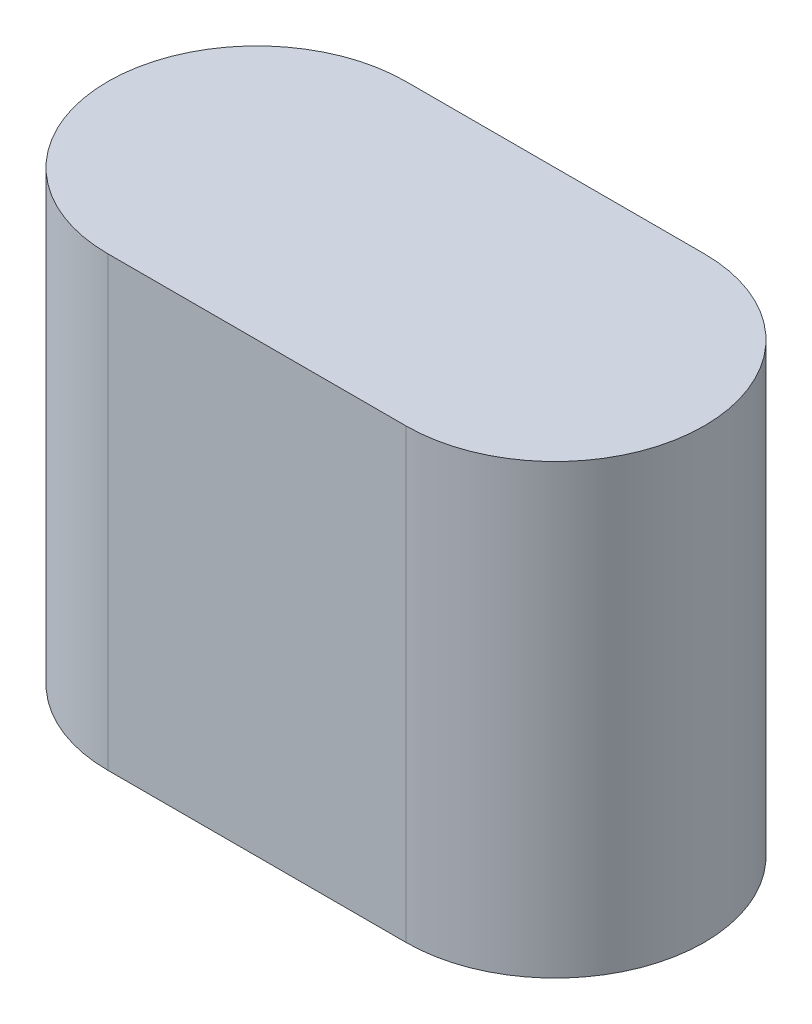
ISO-10303-21;
HEADER;
FILE_DESCRIPTION(('STEP AP214'),'2;1');
FILE_NAME('part.step','',(''),(''),'','','');
FILE_SCHEMA(('AUTOMOTIVE_DESIGN { 1 0 10303 214 1 1 1 1 }'));
ENDSEC;
DATA;
#1=APPLICATION_CONTEXT('core data for automotive mechanical design processes');
#2=APPLICATION_PROTOCOL_DEFINITION('international standard','automotive_design',2000,#1);
#3=PRODUCT_CONTEXT('',#1,'mechanical');
#4=PRODUCT('Part','Part','',(#3));
#5=PRODUCT_RELATED_PRODUCT_CATEGORY('part','',(#4));
#6=PRODUCT_DEFINITION_FORMATION('','',#4);
#7=PRODUCT_DEFINITION_CONTEXT('part definition',#1,'design');
#8=PRODUCT_DEFINITION('design','',#6,#7);
#9=PRODUCT_DEFINITION_SHAPE('','',#8);
#10=(LENGTH_UNIT() NAMED_UNIT(*) SI_UNIT(.MILLI.,.METRE.));
#11=(NAMED_UNIT(*) PLANE_ANGLE_UNIT() SI_UNIT($,.RADIAN.));
#12=(NAMED_UNIT(*) SI_UNIT($,.STERADIAN.) SOLID_ANGLE_UNIT());
#13=UNCERTAINTY_MEASURE_WITH_UNIT(LENGTH_MEASURE(1.E-05),#10,'distance_accuracy_value','');
#14=(GEOMETRIC_REPRESENTATION_CONTEXT(3) GLOBAL_UNCERTAINTY_ASSIGNED_CONTEXT((#13)) GLOBAL_UNIT_ASSIGNED_CONTEXT((#10,
#11,#12)) REPRESENTATION_CONTEXT('',''));
#15=CARTESIAN_POINT('',(0.,0.,0.));
#16=DIRECTION('',(0.,0.,1.));
#17=DIRECTION('',(1.,0.,0.));
#18=AXIS2_PLACEMENT_3D('',#15,#16,#17);
#19=CARTESIAN_POINT('',(-2.54,7.62,0.));
#20=DIRECTION('',(0.,-1.,0.));
#21=DIRECTION('',(0.,0.,-1.));
#22=AXIS2_PLACEMENT_3D('',#19,#20,#21);
#23=CYLINDRICAL_SURFACE('',#22,2.54);
#24=CARTESIAN_POINT('',(-2.54,0.,0.));
#25=DIRECTION('',(0.,1.,0.));
#26=DIRECTION('',(0.,0.,1.));
#27=AXIS2_PLACEMENT_3D('',#24,#25,#26);
#28=CIRCLE('',#27,2.54);
#29=CARTESIAN_POINT('',(-2.54,0.,-2.54));
#30=VERTEX_POINT('',#29);
#31=CARTESIAN_POINT('',(-2.54,0.,2.54));
#32=VERTEX_POINT('',#31);
#33=EDGE_CURVE('E94',#30,#32,#28,.T.);
#34=ORIENTED_EDGE('',*,*,#33,.T.);
#35=DIRECTION('',(0.,-1.,0.));
#36=VECTOR('',#35,1.);
#37=CARTESIAN_POINT('',(-2.54,7.62,2.54));
#38=LINE('',#37,#36);
#39=CARTESIAN_POINT('',(-2.54,7.62,2.54));
#40=VERTEX_POINT('',#39);
#41=EDGE_CURVE('E11',#40,#32,#38,.T.);
#42=ORIENTED_EDGE('',*,*,#41,.F.);
#43=CARTESIAN_POINT('',(-2.54,7.62,0.));
#44=DIRECTION('',(0.,1.,0.));
#45=DIRECTION('',(0.,0.,1.));
#46=AXIS2_PLACEMENT_3D('',#43,#44,#45);
#47=CIRCLE('',#46,2.54);
#48=CARTESIAN_POINT('',(-2.54,7.62,-2.54));
#49=VERTEX_POINT('',#48);
#50=EDGE_CURVE('E82',#49,#40,#47,.T.);
#51=ORIENTED_EDGE('',*,*,#50,.F.);
#52=DIRECTION('',(0.,-1.,0.));
#53=VECTOR('',#52,1.);
#54=CARTESIAN_POINT('',(-2.54,7.62,-2.54));
#55=LINE('',#54,#53);
#56=EDGE_CURVE('E90',#49,#30,#55,.T.);
#57=ORIENTED_EDGE('',*,*,#56,.T.);
#58=EDGE_LOOP('',(#34,#42,#51,#57));
#59=FACE_BOUND('',#58,.T.);
#60=ADVANCED_FACE('F31',(#59),#23,.T.);
#61=CARTESIAN_POINT('',(2.54,7.62,2.54));
#62=DIRECTION('',(0.,0.,-1.));
#63=DIRECTION('',(-1.,0.,0.));
#64=AXIS2_PLACEMENT_3D('',#61,#62,#63);
#65=PLANE('',#64);
#66=DIRECTION('',(1.,0.,0.));
#67=VECTOR('',#66,1.);
#68=CARTESIAN_POINT('',(2.54,0.,2.54));
#69=LINE('',#68,#67);
#70=CARTESIAN_POINT('',(2.54,0.,2.54));
#71=VERTEX_POINT('',#70);
#72=EDGE_CURVE('E86',#32,#71,#69,.T.);
#73=ORIENTED_EDGE('',*,*,#72,.T.);
#74=DIRECTION('',(0.,-1.,0.));
#75=VECTOR('',#74,1.);
#76=CARTESIAN_POINT('',(2.54,7.62,2.54));
#77=LINE('',#76,#75);
#78=CARTESIAN_POINT('',(2.54,7.62,2.54));
#79=VERTEX_POINT('',#78);
#80=EDGE_CURVE('E39',#79,#71,#77,.T.);
#81=ORIENTED_EDGE('',*,*,#80,.F.);
#82=DIRECTION('',(1.,0.,0.));
#83=VECTOR('',#82,1.);
#84=CARTESIAN_POINT('',(2.54,7.62,2.54));
#85=LINE('',#84,#83);
#86=EDGE_CURVE('E77',#40,#79,#85,.T.);
#87=ORIENTED_EDGE('',*,*,#86,.F.);
#88=ORIENTED_EDGE('',*,*,#41,.T.);
#89=EDGE_LOOP('',(#73,#81,#87,#88));
#90=FACE_BOUND('',#89,.T.);
#91=ADVANCED_FACE('F85',(#90),#65,.F.);
#92=CARTESIAN_POINT('',(2.54,7.62,0.));
#93=DIRECTION('',(0.,-1.,0.));
#94=DIRECTION('',(0.,0.,-1.));
#95=AXIS2_PLACEMENT_3D('',#92,#93,#94);
#96=CYLINDRICAL_SURFACE('',#95,2.54);
#97=CARTESIAN_POINT('',(2.54,0.,0.));
#98=DIRECTION('',(0.,1.,0.));
#99=DIRECTION('',(0.,0.,1.));
#100=AXIS2_PLACEMENT_3D('',#97,#98,#99);
#101=CIRCLE('',#100,2.54);
#102=CARTESIAN_POINT('',(2.54,0.,-2.54));
#103=VERTEX_POINT('',#102);
#104=EDGE_CURVE('E64',#71,#103,#101,.T.);
#105=ORIENTED_EDGE('',*,*,#104,.T.);
#106=DIRECTION('',(0.,-1.,0.));
#107=VECTOR('',#106,1.);
#108=CARTESIAN_POINT('',(2.54,7.62,-2.54));
#109=LINE('',#108,#107);
#110=CARTESIAN_POINT('',(2.54,7.62,-2.54));
#111=VERTEX_POINT('',#110);
#112=EDGE_CURVE('E87',#111,#103,#109,.T.);
#113=ORIENTED_EDGE('',*,*,#112,.F.);
#114=CARTESIAN_POINT('',(2.54,7.62,0.));
#115=DIRECTION('',(0.,1.,0.));
#116=DIRECTION('',(0.,0.,1.));
#117=AXIS2_PLACEMENT_3D('',#114,#115,#116);
#118=CIRCLE('',#117,2.54);
#119=EDGE_CURVE('E80',#79,#111,#118,.T.);
#120=ORIENTED_EDGE('',*,*,#119,.F.);
#121=ORIENTED_EDGE('',*,*,#80,.T.);
#122=EDGE_LOOP('',(#105,#113,#120,#121));
#123=FACE_BOUND('',#122,.T.);
#124=ADVANCED_FACE('F88',(#123),#96,.T.);
#125=CARTESIAN_POINT('',(-2.54,7.62,-2.54));
#126=DIRECTION('',(0.,0.,1.));
#127=DIRECTION('',(1.,0.,0.));
#128=AXIS2_PLACEMENT_3D('',#125,#126,#127);
#129=PLANE('',#128);
#130=DIRECTION('',(-1.,0.,0.));
#131=VECTOR('',#130,1.);
#132=CARTESIAN_POINT('',(-2.54,0.,-2.54));
#133=LINE('',#132,#131);
#134=EDGE_CURVE('E70',#103,#30,#133,.T.);
#135=ORIENTED_EDGE('',*,*,#134,.T.);
#136=ORIENTED_EDGE('',*,*,#56,.F.);
#137=DIRECTION('',(-1.,0.,0.));
#138=VECTOR('',#137,1.);
#139=CARTESIAN_POINT('',(-2.54,7.62,-2.54));
#140=LINE('',#139,#138);
#141=EDGE_CURVE('E47',#111,#49,#140,.T.);
#142=ORIENTED_EDGE('',*,*,#141,.F.);
#143=ORIENTED_EDGE('',*,*,#112,.T.);
#144=EDGE_LOOP('',(#135,#136,#142,#143));
#145=FACE_BOUND('',#144,.T.);
#146=ADVANCED_FACE('F101',(#145),#129,.F.);
#147=CARTESIAN_POINT('',(-2.54,7.62,0.));
#148=DIRECTION('',(0.,1.,0.));
#149=DIRECTION('',(0.,0.,1.));
#150=AXIS2_PLACEMENT_3D('',#147,#148,#149);
#151=PLANE('',#150);
#152=ORIENTED_EDGE('',*,*,#50,.T.);
#153=ORIENTED_EDGE('',*,*,#86,.T.);
#154=ORIENTED_EDGE('',*,*,#119,.T.);
#155=ORIENTED_EDGE('',*,*,#141,.T.);
#156=EDGE_LOOP('',(#152,#153,#154,#155));
#157=FACE_BOUND('',#156,.T.);
#158=ADVANCED_FACE('F78',(#157),#151,.T.);
#159=CARTESIAN_POINT('',(-2.54,0.,0.));
#160=DIRECTION('',(0.,1.,0.));
#161=DIRECTION('',(0.,0.,1.));
#162=AXIS2_PLACEMENT_3D('',#159,#160,#161);
#163=PLANE('',#162);
#164=ORIENTED_EDGE('',*,*,#33,.F.);
#165=ORIENTED_EDGE('',*,*,#134,.F.);
#166=ORIENTED_EDGE('',*,*,#104,.F.);
#167=ORIENTED_EDGE('',*,*,#72,.F.);
#168=EDGE_LOOP('',(#164,#165,#166,#167));
#169=FACE_BOUND('',#168,.T.);
#170=ADVANCED_FACE('F104',(#169),#163,.F.);
#171=CLOSED_SHELL('',(#60,#91,#124,#146,#158,#170));
#172=MANIFOLD_SOLID_BREP('B2',#171);
#173=ADVANCED_BREP_SHAPE_REPRESENTATION('',(#18,#172),#14);
#174=SHAPE_DEFINITION_REPRESENTATION(#9,#173);
ENDSEC;
END-ISO-10303-21;
